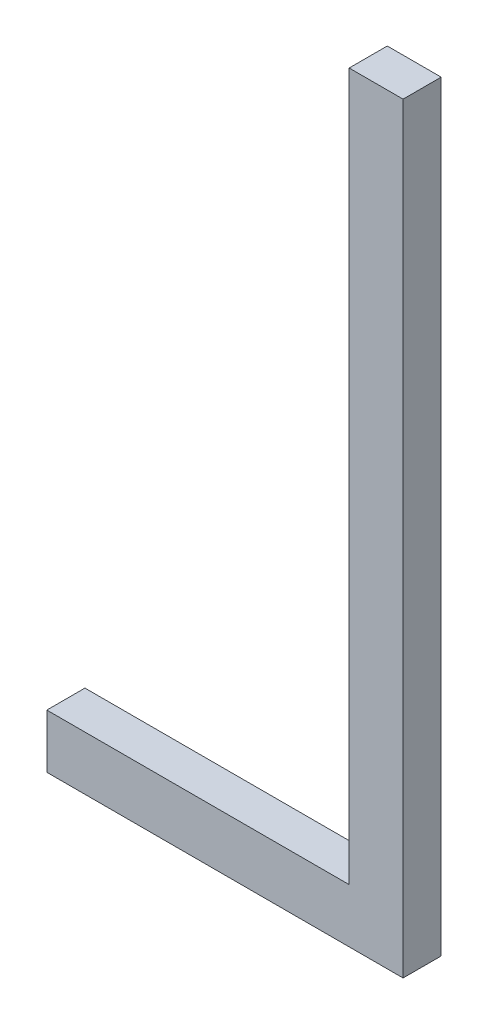
ISO-10303-21;
HEADER;
FILE_DESCRIPTION(('STEP AP214'),'2;1');
FILE_NAME('part.step','',(''),(''),'','','');
FILE_SCHEMA(('AUTOMOTIVE_DESIGN { 1 0 10303 214 1 1 1 1 }'));
ENDSEC;
DATA;
#1=APPLICATION_CONTEXT('core data for automotive mechanical design processes');
#2=APPLICATION_PROTOCOL_DEFINITION('international standard','automotive_design',2000,#1);
#3=PRODUCT_CONTEXT('',#1,'mechanical');
#4=PRODUCT('Part','Part','',(#3));
#5=PRODUCT_RELATED_PRODUCT_CATEGORY('part','',(#4));
#6=PRODUCT_DEFINITION_FORMATION('','',#4);
#7=PRODUCT_DEFINITION_CONTEXT('part definition',#1,'design');
#8=PRODUCT_DEFINITION('design','',#6,#7);
#9=PRODUCT_DEFINITION_SHAPE('','',#8);
#10=(LENGTH_UNIT() NAMED_UNIT(*) SI_UNIT(.MILLI.,.METRE.));
#11=(NAMED_UNIT(*) PLANE_ANGLE_UNIT() SI_UNIT($,.RADIAN.));
#12=(NAMED_UNIT(*) SI_UNIT($,.STERADIAN.) SOLID_ANGLE_UNIT());
#13=UNCERTAINTY_MEASURE_WITH_UNIT(LENGTH_MEASURE(1.E-05),#10,'distance_accuracy_value','');
#14=(GEOMETRIC_REPRESENTATION_CONTEXT(3) GLOBAL_UNCERTAINTY_ASSIGNED_CONTEXT((#13)) GLOBAL_UNIT_ASSIGNED_CONTEXT((#10,
#11,#12)) REPRESENTATION_CONTEXT('',''));
#15=CARTESIAN_POINT('',(0.,0.,0.));
#16=DIRECTION('',(0.,0.,1.));
#17=DIRECTION('',(1.,0.,0.));
#18=AXIS2_PLACEMENT_3D('',#15,#16,#17);
#19=CARTESIAN_POINT('',(150.86216756889,58.2791772221511,-39.1));
#20=DIRECTION('',(0.,0.,1.));
#21=DIRECTION('',(1.,0.,0.));
#22=AXIS2_PLACEMENT_3D('',#19,#20,#21);
#23=PLANE('',#22);
#24=DIRECTION('',(1.,0.,0.));
#25=VECTOR('',#24,1.);
#26=CARTESIAN_POINT('',(150.86216756889,58.4206474024611,-39.1));
#27=LINE('',#26,#25);
#28=CARTESIAN_POINT('',(151.65551014864,58.4206474024611,-39.1));
#29=VERTEX_POINT('',#28);
#30=CARTESIAN_POINT('',(150.86216756889,58.4206474024611,-39.1));
#31=VERTEX_POINT('',#30);
#32=EDGE_CURVE('E20',#29,#31,#27,.F.);
#33=ORIENTED_EDGE('',*,*,#32,.F.);
#34=DIRECTION('',(0.,1.,0.));
#35=VECTOR('',#34,1.);
#36=CARTESIAN_POINT('',(151.65551014864,60.2764032970511,-39.1));
#37=LINE('',#36,#35);
#38=CARTESIAN_POINT('',(151.65551014864,60.2764032970511,-39.1));
#39=VERTEX_POINT('',#38);
#40=EDGE_CURVE('E100',#29,#39,#37,.T.);
#41=ORIENTED_EDGE('',*,*,#40,.T.);
#42=DIRECTION('',(1.,0.,0.));
#43=VECTOR('',#42,1.);
#44=CARTESIAN_POINT('',(151.79698032894,60.2764032970511,-39.1));
#45=LINE('',#44,#43);
#46=CARTESIAN_POINT('',(151.79698032894,60.2764032970511,-39.1));
#47=VERTEX_POINT('',#46);
#48=EDGE_CURVE('E96',#39,#47,#45,.T.);
#49=ORIENTED_EDGE('',*,*,#48,.T.);
#50=DIRECTION('',(0.,1.,0.));
#51=VECTOR('',#50,1.);
#52=CARTESIAN_POINT('',(151.79698032894,58.2791772221511,-39.1));
#53=LINE('',#52,#51);
#54=CARTESIAN_POINT('',(151.79698032894,58.2791772221511,-39.1));
#55=VERTEX_POINT('',#54);
#56=EDGE_CURVE('E82',#47,#55,#53,.F.);
#57=ORIENTED_EDGE('',*,*,#56,.T.);
#58=DIRECTION('',(1.,0.,0.));
#59=VECTOR('',#58,1.);
#60=CARTESIAN_POINT('',(150.86216756889,58.2791772221511,-39.1));
#61=LINE('',#60,#59);
#62=CARTESIAN_POINT('',(150.86216756889,58.2791772221511,-39.1));
#63=VERTEX_POINT('',#62);
#64=EDGE_CURVE('E68',#55,#63,#61,.F.);
#65=ORIENTED_EDGE('',*,*,#64,.T.);
#66=DIRECTION('',(0.,1.,0.));
#67=VECTOR('',#66,1.);
#68=CARTESIAN_POINT('',(150.86216756889,58.4206474024611,-39.1));
#69=LINE('',#68,#67);
#70=EDGE_CURVE('E74',#63,#31,#69,.T.);
#71=ORIENTED_EDGE('',*,*,#70,.T.);
#72=EDGE_LOOP('',(#33,#41,#49,#57,#65,#71));
#73=FACE_BOUND('',#72,.T.);
#74=ADVANCED_FACE('F17',(#73),#23,.F.);
#75=CARTESIAN_POINT('',(150.86216756889,58.4206474024611,-39.));
#76=DIRECTION('',(1.,0.,0.));
#77=DIRECTION('',(0.,0.,-1.));
#78=AXIS2_PLACEMENT_3D('',#75,#76,#77);
#79=PLANE('',#78);
#80=DIRECTION('',(0.,0.,1.));
#81=VECTOR('',#80,1.);
#82=CARTESIAN_POINT('',(150.86216756889,58.2791772221511,-39.));
#83=LINE('',#82,#81);
#84=CARTESIAN_POINT('',(150.86216756889,58.2791772221511,-39.));
#85=VERTEX_POINT('',#84);
#86=EDGE_CURVE('E76',#63,#85,#83,.T.);
#87=ORIENTED_EDGE('',*,*,#86,.T.);
#88=DIRECTION('',(0.,1.,0.));
#89=VECTOR('',#88,1.);
#90=CARTESIAN_POINT('',(150.86216756889,58.2791772221511,-39.));
#91=LINE('',#90,#89);
#92=CARTESIAN_POINT('',(150.86216756889,58.4206474024611,-39.));
#93=VERTEX_POINT('',#92);
#94=EDGE_CURVE('E105',#93,#85,#91,.F.);
#95=ORIENTED_EDGE('',*,*,#94,.F.);
#96=DIRECTION('',(0.,0.,-1.));
#97=VECTOR('',#96,1.);
#98=CARTESIAN_POINT('',(150.86216756889,58.4206474024611,-39.));
#99=LINE('',#98,#97);
#100=EDGE_CURVE('E79',#93,#31,#99,.T.);
#101=ORIENTED_EDGE('',*,*,#100,.T.);
#102=ORIENTED_EDGE('',*,*,#70,.F.);
#103=EDGE_LOOP('',(#87,#95,#101,#102));
#104=FACE_BOUND('',#103,.T.);
#105=ADVANCED_FACE('F75',(#104),#79,.F.);
#106=CARTESIAN_POINT('',(150.86216756889,58.2791772221511,-39.));
#107=DIRECTION('',(0.,1.,0.));
#108=DIRECTION('',(0.,0.,1.));
#109=AXIS2_PLACEMENT_3D('',#106,#107,#108);
#110=PLANE('',#109);
#111=DIRECTION('',(0.,0.,1.));
#112=VECTOR('',#111,1.);
#113=CARTESIAN_POINT('',(151.79698032894,58.2791772221511,-39.));
#114=LINE('',#113,#112);
#115=CARTESIAN_POINT('',(151.79698032894,58.2791772221511,-39.));
#116=VERTEX_POINT('',#115);
#117=EDGE_CURVE('E84',#55,#116,#114,.T.);
#118=ORIENTED_EDGE('',*,*,#117,.T.);
#119=DIRECTION('',(1.,0.,0.));
#120=VECTOR('',#119,1.);
#121=CARTESIAN_POINT('',(150.86216756889,58.2791772221511,-39.));
#122=LINE('',#121,#120);
#123=EDGE_CURVE('E88',#85,#116,#122,.T.);
#124=ORIENTED_EDGE('',*,*,#123,.F.);
#125=ORIENTED_EDGE('',*,*,#86,.F.);
#126=ORIENTED_EDGE('',*,*,#64,.F.);
#127=EDGE_LOOP('',(#118,#124,#125,#126));
#128=FACE_BOUND('',#127,.T.);
#129=ADVANCED_FACE('F86',(#128),#110,.F.);
#130=CARTESIAN_POINT('',(151.79698032894,58.2791772221511,-39.));
#131=DIRECTION('',(-1.,0.,0.));
#132=DIRECTION('',(0.,0.,1.));
#133=AXIS2_PLACEMENT_3D('',#130,#131,#132);
#134=PLANE('',#133);
#135=DIRECTION('',(0.,0.,-1.));
#136=VECTOR('',#135,1.);
#137=CARTESIAN_POINT('',(151.79698032894,60.2764032970511,-39.));
#138=LINE('',#137,#136);
#139=CARTESIAN_POINT('',(151.79698032894,60.2764032970511,-39.));
#140=VERTEX_POINT('',#139);
#141=EDGE_CURVE('E94',#47,#140,#138,.F.);
#142=ORIENTED_EDGE('',*,*,#141,.T.);
#143=DIRECTION('',(0.,1.,0.));
#144=VECTOR('',#143,1.);
#145=CARTESIAN_POINT('',(151.79698032894,58.2791772221511,-39.));
#146=LINE('',#145,#144);
#147=EDGE_CURVE('E108',#116,#140,#146,.T.);
#148=ORIENTED_EDGE('',*,*,#147,.F.);
#149=ORIENTED_EDGE('',*,*,#117,.F.);
#150=ORIENTED_EDGE('',*,*,#56,.F.);
#151=EDGE_LOOP('',(#142,#148,#149,#150));
#152=FACE_BOUND('',#151,.T.);
#153=ADVANCED_FACE('F137',(#152),#134,.F.);
#154=CARTESIAN_POINT('',(151.79698032894,60.2764032970511,-39.));
#155=DIRECTION('',(0.,-1.,0.));
#156=DIRECTION('',(0.,0.,-1.));
#157=AXIS2_PLACEMENT_3D('',#154,#155,#156);
#158=PLANE('',#157);
#159=DIRECTION('',(0.,0.,-1.));
#160=VECTOR('',#159,1.);
#161=CARTESIAN_POINT('',(151.65551014864,60.2764032970511,-39.));
#162=LINE('',#161,#160);
#163=CARTESIAN_POINT('',(151.65551014864,60.2764032970511,-39.));
#164=VERTEX_POINT('',#163);
#165=EDGE_CURVE('E98',#39,#164,#162,.F.);
#166=ORIENTED_EDGE('',*,*,#165,.T.);
#167=DIRECTION('',(1.,0.,0.));
#168=VECTOR('',#167,1.);
#169=CARTESIAN_POINT('',(150.86216756889,60.2764032970511,-39.));
#170=LINE('',#169,#168);
#171=EDGE_CURVE('E111',#140,#164,#170,.F.);
#172=ORIENTED_EDGE('',*,*,#171,.F.);
#173=ORIENTED_EDGE('',*,*,#141,.F.);
#174=ORIENTED_EDGE('',*,*,#48,.F.);
#175=EDGE_LOOP('',(#166,#172,#173,#174));
#176=FACE_BOUND('',#175,.T.);
#177=ADVANCED_FACE('F121',(#176),#158,.F.);
#178=CARTESIAN_POINT('',(151.65551014864,60.2764032970511,-39.));
#179=DIRECTION('',(1.,0.,0.));
#180=DIRECTION('',(0.,0.,-1.));
#181=AXIS2_PLACEMENT_3D('',#178,#179,#180);
#182=PLANE('',#181);
#183=DIRECTION('',(0.,0.,-1.));
#184=VECTOR('',#183,1.);
#185=CARTESIAN_POINT('',(151.65551014864,58.4206474024611,-39.));
#186=LINE('',#185,#184);
#187=CARTESIAN_POINT('',(151.65551014864,58.4206474024611,-39.));
#188=VERTEX_POINT('',#187);
#189=EDGE_CURVE('E35',#29,#188,#186,.F.);
#190=ORIENTED_EDGE('',*,*,#189,.T.);
#191=DIRECTION('',(0.,1.,0.));
#192=VECTOR('',#191,1.);
#193=CARTESIAN_POINT('',(151.65551014864,58.2791772221511,-39.));
#194=LINE('',#193,#192);
#195=EDGE_CURVE('E26',#164,#188,#194,.F.);
#196=ORIENTED_EDGE('',*,*,#195,.F.);
#197=ORIENTED_EDGE('',*,*,#165,.F.);
#198=ORIENTED_EDGE('',*,*,#40,.F.);
#199=EDGE_LOOP('',(#190,#196,#197,#198));
#200=FACE_BOUND('',#199,.T.);
#201=ADVANCED_FACE('F119',(#200),#182,.F.);
#202=CARTESIAN_POINT('',(151.65551014864,58.4206474024611,-39.));
#203=DIRECTION('',(0.,-1.,0.));
#204=DIRECTION('',(0.,0.,-1.));
#205=AXIS2_PLACEMENT_3D('',#202,#203,#204);
#206=PLANE('',#205);
#207=ORIENTED_EDGE('',*,*,#100,.F.);
#208=DIRECTION('',(1.,0.,0.));
#209=VECTOR('',#208,1.);
#210=CARTESIAN_POINT('',(150.86216756889,58.4206474024611,-39.));
#211=LINE('',#210,#209);
#212=EDGE_CURVE('E11',#188,#93,#211,.F.);
#213=ORIENTED_EDGE('',*,*,#212,.F.);
#214=ORIENTED_EDGE('',*,*,#189,.F.);
#215=ORIENTED_EDGE('',*,*,#32,.T.);
#216=EDGE_LOOP('',(#207,#213,#214,#215));
#217=FACE_BOUND('',#216,.T.);
#218=ADVANCED_FACE('F124',(#217),#206,.F.);
#219=CARTESIAN_POINT('',(150.86216756889,58.2791772221511,-39.));
#220=DIRECTION('',(0.,0.,1.));
#221=DIRECTION('',(1.,0.,0.));
#222=AXIS2_PLACEMENT_3D('',#219,#220,#221);
#223=PLANE('',#222);
#224=ORIENTED_EDGE('',*,*,#195,.T.);
#225=ORIENTED_EDGE('',*,*,#212,.T.);
#226=ORIENTED_EDGE('',*,*,#94,.T.);
#227=ORIENTED_EDGE('',*,*,#123,.T.);
#228=ORIENTED_EDGE('',*,*,#147,.T.);
#229=ORIENTED_EDGE('',*,*,#171,.T.);
#230=EDGE_LOOP('',(#224,#225,#226,#227,#228,#229));
#231=FACE_BOUND('',#230,.T.);
#232=ADVANCED_FACE('F116',(#231),#223,.T.);
#233=CLOSED_SHELL('',(#74,#105,#129,#153,#177,#201,#218,#232));
#234=MANIFOLD_SOLID_BREP('B1',#233);
#235=ADVANCED_BREP_SHAPE_REPRESENTATION('',(#18,#234),#14);
#236=SHAPE_DEFINITION_REPRESENTATION(#9,#235);
ENDSEC;
END-ISO-10303-21;
